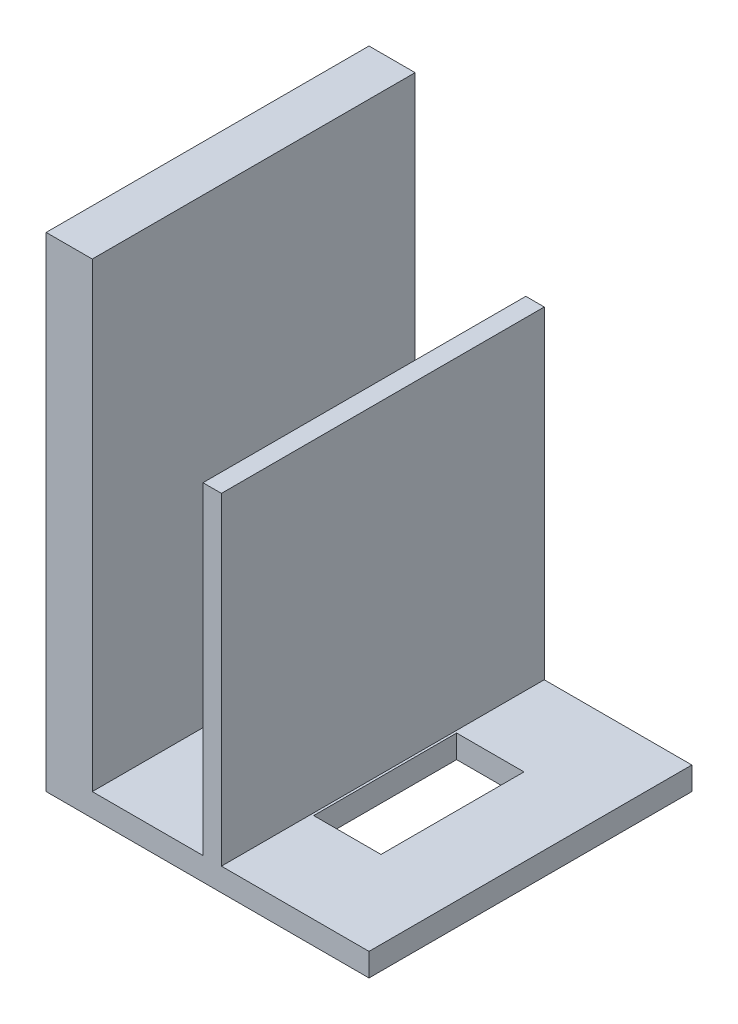
ISO-10303-21;
HEADER;
FILE_DESCRIPTION(('STEP AP214'),'2;1');
FILE_NAME('part.step','',(''),(''),'','','');
FILE_SCHEMA(('AUTOMOTIVE_DESIGN { 1 0 10303 214 1 1 1 1 }'));
ENDSEC;
DATA;
#1=APPLICATION_CONTEXT('core data for automotive mechanical design processes');
#2=APPLICATION_PROTOCOL_DEFINITION('international standard','automotive_design',2000,#1);
#3=PRODUCT_CONTEXT('',#1,'mechanical');
#4=PRODUCT('Part','Part','',(#3));
#5=PRODUCT_RELATED_PRODUCT_CATEGORY('part','',(#4));
#6=PRODUCT_DEFINITION_FORMATION('','',#4);
#7=PRODUCT_DEFINITION_CONTEXT('part definition',#1,'design');
#8=PRODUCT_DEFINITION('design','',#6,#7);
#9=PRODUCT_DEFINITION_SHAPE('','',#8);
#10=(LENGTH_UNIT() NAMED_UNIT(*) SI_UNIT(.MILLI.,.METRE.));
#11=(NAMED_UNIT(*) PLANE_ANGLE_UNIT() SI_UNIT($,.RADIAN.));
#12=(NAMED_UNIT(*) SI_UNIT($,.STERADIAN.) SOLID_ANGLE_UNIT());
#13=UNCERTAINTY_MEASURE_WITH_UNIT(LENGTH_MEASURE(1.E-05),#10,'distance_accuracy_value','');
#14=(GEOMETRIC_REPRESENTATION_CONTEXT(3) GLOBAL_UNCERTAINTY_ASSIGNED_CONTEXT((#13)) GLOBAL_UNIT_ASSIGNED_CONTEXT((#10,
#11,#12)) REPRESENTATION_CONTEXT('',''));
#15=CARTESIAN_POINT('',(0.,0.,0.));
#16=DIRECTION('',(0.,0.,1.));
#17=DIRECTION('',(1.,0.,0.));
#18=AXIS2_PLACEMENT_3D('',#15,#16,#17);
#19=CARTESIAN_POINT('',(0.,2.5,0.));
#20=DIRECTION('',(0.,-1.,0.));
#21=DIRECTION('',(0.,0.,-1.));
#22=AXIS2_PLACEMENT_3D('',#19,#20,#21);
#23=PLANE('',#22);
#24=CARTESIAN_POINT('',(10.75,2.5,-17.5));
#25=DIRECTION('',(0.,1.,0.));
#26=DIRECTION('',(0.,0.,1.));
#27=AXIS2_PLACEMENT_3D('',#24,#25,#26);
#28=CIRCLE('',#27,5.);
#29=CARTESIAN_POINT('',(10.75,2.5,-12.5));
#30=VERTEX_POINT('',#29);
#31=EDGE_CURVE('E257',#30,#30,#28,.T.);
#32=ORIENTED_EDGE('',*,*,#31,.F.);
#33=EDGE_LOOP('',(#32));
#34=FACE_BOUND('',#33,.T.);
#35=DIRECTION('',(0.,0.,1.));
#36=VECTOR('',#35,1.);
#37=CARTESIAN_POINT('',(17.,2.5,0.));
#38=LINE('',#37,#36);
#39=CARTESIAN_POINT('',(17.,2.5,-35.));
#40=VERTEX_POINT('',#39);
#41=CARTESIAN_POINT('',(17.,2.5,0.));
#42=VERTEX_POINT('',#41);
#43=EDGE_CURVE('E215',#40,#42,#38,.T.);
#44=ORIENTED_EDGE('',*,*,#43,.F.);
#45=DIRECTION('',(-1.,0.,0.));
#46=VECTOR('',#45,1.);
#47=CARTESIAN_POINT('',(0.,2.5,-35.));
#48=LINE('',#47,#46);
#49=CARTESIAN_POINT('',(4.99999999999999,2.5,-35.));
#50=VERTEX_POINT('',#49);
#51=EDGE_CURVE('E339',#40,#50,#48,.T.);
#52=ORIENTED_EDGE('',*,*,#51,.T.);
#53=DIRECTION('',(0.,0.,-1.));
#54=VECTOR('',#53,1.);
#55=CARTESIAN_POINT('',(4.99999999999999,2.5,-35.));
#56=LINE('',#55,#54);
#57=CARTESIAN_POINT('',(4.99999999999999,2.5,0.));
#58=VERTEX_POINT('',#57);
#59=EDGE_CURVE('E296',#58,#50,#56,.T.);
#60=ORIENTED_EDGE('',*,*,#59,.F.);
#61=DIRECTION('',(1.,0.,0.));
#62=VECTOR('',#61,1.);
#63=CARTESIAN_POINT('',(0.,2.5,0.));
#64=LINE('',#63,#62);
#65=EDGE_CURVE('E332',#58,#42,#64,.T.);
#66=ORIENTED_EDGE('',*,*,#65,.T.);
#67=EDGE_LOOP('',(#44,#52,#60,#66));
#68=FACE_BOUND('',#67,.T.);
#69=ADVANCED_FACE('F45',(#34,#68),#23,.F.);
#70=DIRECTION('',(-1.,0.,0.));
#71=VECTOR('',#70,1.);
#72=CARTESIAN_POINT('',(26.55,2.5,-25.25));
#73=LINE('',#72,#71);
#74=CARTESIAN_POINT('',(26.55,2.5,-25.25));
#75=VERTEX_POINT('',#74);
#76=CARTESIAN_POINT('',(19.25,2.5,-25.25));
#77=VERTEX_POINT('',#76);
#78=EDGE_CURVE('E206',#75,#77,#73,.T.);
#79=ORIENTED_EDGE('',*,*,#78,.F.);
#80=DIRECTION('',(0.,0.,-1.));
#81=VECTOR('',#80,1.);
#82=CARTESIAN_POINT('',(26.55,2.5,-9.75000000000001));
#83=LINE('',#82,#81);
#84=CARTESIAN_POINT('',(26.55,2.5,-9.75000000000001));
#85=VERTEX_POINT('',#84);
#86=EDGE_CURVE('E62',#85,#75,#83,.T.);
#87=ORIENTED_EDGE('',*,*,#86,.F.);
#88=DIRECTION('',(1.,0.,0.));
#89=VECTOR('',#88,1.);
#90=CARTESIAN_POINT('',(26.55,2.5,-9.75000000000001));
#91=LINE('',#90,#89);
#92=CARTESIAN_POINT('',(19.25,2.5,-9.75000000000001));
#93=VERTEX_POINT('',#92);
#94=EDGE_CURVE('E193',#93,#85,#91,.T.);
#95=ORIENTED_EDGE('',*,*,#94,.F.);
#96=DIRECTION('',(0.,0.,1.));
#97=VECTOR('',#96,1.);
#98=CARTESIAN_POINT('',(19.25,2.5,-9.75000000000001));
#99=LINE('',#98,#97);
#100=EDGE_CURVE('E197',#77,#93,#99,.T.);
#101=ORIENTED_EDGE('',*,*,#100,.F.);
#102=EDGE_LOOP('',(#79,#87,#95,#101));
#103=FACE_BOUND('',#102,.T.);
#104=DIRECTION('',(0.,0.,-1.));
#105=VECTOR('',#104,1.);
#106=CARTESIAN_POINT('',(19.,2.5,0.));
#107=LINE('',#106,#105);
#108=CARTESIAN_POINT('',(19.,2.5,0.));
#109=VERTEX_POINT('',#108);
#110=CARTESIAN_POINT('',(19.,2.5,-35.));
#111=VERTEX_POINT('',#110);
#112=EDGE_CURVE('E226',#109,#111,#107,.T.);
#113=ORIENTED_EDGE('',*,*,#112,.F.);
#114=CARTESIAN_POINT('',(35.,2.5,0.));
#115=VERTEX_POINT('',#114);
#116=EDGE_CURVE('E336',#109,#115,#64,.T.);
#117=ORIENTED_EDGE('',*,*,#116,.T.);
#118=DIRECTION('',(0.,0.,-1.));
#119=VECTOR('',#118,1.);
#120=CARTESIAN_POINT('',(35.,2.5,0.));
#121=LINE('',#120,#119);
#122=CARTESIAN_POINT('',(35.,2.5,-35.));
#123=VERTEX_POINT('',#122);
#124=EDGE_CURVE('E335',#115,#123,#121,.T.);
#125=ORIENTED_EDGE('',*,*,#124,.T.);
#126=EDGE_CURVE('E340',#123,#111,#48,.T.);
#127=ORIENTED_EDGE('',*,*,#126,.T.);
#128=EDGE_LOOP('',(#113,#117,#125,#127));
#129=FACE_BOUND('',#128,.T.);
#130=ADVANCED_FACE('F408',(#103,#129),#23,.F.);
#131=CARTESIAN_POINT('',(0.,2.5,0.));
#132=DIRECTION('',(1.,0.,0.));
#133=DIRECTION('',(0.,0.,-1.));
#134=AXIS2_PLACEMENT_3D('',#131,#132,#133);
#135=PLANE('',#134);
#136=DIRECTION('',(0.,0.,1.));
#137=VECTOR('',#136,1.);
#138=CARTESIAN_POINT('',(0.,12.5,-26.0538512246076));
#139=LINE('',#138,#137);
#140=CARTESIAN_POINT('',(0.,12.5,-26.0538512246076));
#141=VERTEX_POINT('',#140);
#142=CARTESIAN_POINT('',(0.,12.5,-9.05385122460765));
#143=VERTEX_POINT('',#142);
#144=EDGE_CURVE('E282',#141,#143,#139,.T.);
#145=ORIENTED_EDGE('',*,*,#144,.F.);
#146=DIRECTION('',(0.,-1.,0.));
#147=VECTOR('',#146,1.);
#148=CARTESIAN_POINT('',(0.,47.5,-26.0538512246077));
#149=LINE('',#148,#147);
#150=CARTESIAN_POINT('',(0.,47.5,-26.0538512246077));
#151=VERTEX_POINT('',#150);
#152=EDGE_CURVE('E279',#151,#141,#149,.T.);
#153=ORIENTED_EDGE('',*,*,#152,.F.);
#154=DIRECTION('',(0.,0.,-1.));
#155=VECTOR('',#154,1.);
#156=CARTESIAN_POINT('',(0.,47.5,-26.0538512246077));
#157=LINE('',#156,#155);
#158=CARTESIAN_POINT('',(0.,47.5,-9.05385122460765));
#159=VERTEX_POINT('',#158);
#160=EDGE_CURVE('E266',#159,#151,#157,.T.);
#161=ORIENTED_EDGE('',*,*,#160,.F.);
#162=DIRECTION('',(0.,1.,0.));
#163=VECTOR('',#162,1.);
#164=CARTESIAN_POINT('',(0.,47.5,-9.05385122460765));
#165=LINE('',#164,#163);
#166=EDGE_CURVE('E286',#143,#159,#165,.T.);
#167=ORIENTED_EDGE('',*,*,#166,.F.);
#168=EDGE_LOOP('',(#145,#153,#161,#167));
#169=FACE_BOUND('',#168,.T.);
#170=DIRECTION('',(0.,0.,1.));
#171=VECTOR('',#170,1.);
#172=CARTESIAN_POINT('',(0.,0.,0.));
#173=LINE('',#172,#171);
#174=CARTESIAN_POINT('',(0.,0.,-35.));
#175=VERTEX_POINT('',#174);
#176=CARTESIAN_POINT('',(0.,0.,0.));
#177=VERTEX_POINT('',#176);
#178=EDGE_CURVE('E331',#175,#177,#173,.T.);
#179=ORIENTED_EDGE('',*,*,#178,.T.);
#180=DIRECTION('',(0.,-1.,0.));
#181=VECTOR('',#180,1.);
#182=CARTESIAN_POINT('',(0.,2.5,0.));
#183=LINE('',#182,#181);
#184=CARTESIAN_POINT('',(0.,52.5,0.));
#185=VERTEX_POINT('',#184);
#186=EDGE_CURVE('E11',#185,#177,#183,.T.);
#187=ORIENTED_EDGE('',*,*,#186,.F.);
#188=DIRECTION('',(0.,0.,1.));
#189=VECTOR('',#188,1.);
#190=CARTESIAN_POINT('',(0.,52.5,-35.));
#191=LINE('',#190,#189);
#192=CARTESIAN_POINT('',(0.,52.5,-35.));
#193=VERTEX_POINT('',#192);
#194=EDGE_CURVE('E306',#193,#185,#191,.T.);
#195=ORIENTED_EDGE('',*,*,#194,.F.);
#196=DIRECTION('',(0.,-1.,0.));
#197=VECTOR('',#196,1.);
#198=CARTESIAN_POINT('',(0.,2.5,-35.));
#199=LINE('',#198,#197);
#200=EDGE_CURVE('E343',#193,#175,#199,.T.);
#201=ORIENTED_EDGE('',*,*,#200,.T.);
#202=EDGE_LOOP('',(#179,#187,#195,#201));
#203=FACE_BOUND('',#202,.T.);
#204=ADVANCED_FACE('F47',(#169,#203),#135,.F.);
#205=CARTESIAN_POINT('',(0.,2.5,0.));
#206=DIRECTION('',(0.,0.,-1.));
#207=DIRECTION('',(-1.,0.,0.));
#208=AXIS2_PLACEMENT_3D('',#205,#206,#207);
#209=PLANE('',#208);
#210=DIRECTION('',(1.,0.,0.));
#211=VECTOR('',#210,1.);
#212=CARTESIAN_POINT('',(0.,0.,0.));
#213=LINE('',#212,#211);
#214=CARTESIAN_POINT('',(35.,0.,0.));
#215=VERTEX_POINT('',#214);
#216=EDGE_CURVE('E347',#177,#215,#213,.T.);
#217=ORIENTED_EDGE('',*,*,#216,.T.);
#218=DIRECTION('',(0.,-1.,0.));
#219=VECTOR('',#218,1.);
#220=CARTESIAN_POINT('',(35.,2.5,0.));
#221=LINE('',#220,#219);
#222=EDGE_CURVE('E55',#115,#215,#221,.T.);
#223=ORIENTED_EDGE('',*,*,#222,.F.);
#224=ORIENTED_EDGE('',*,*,#116,.F.);
#225=DIRECTION('',(0.,-1.,0.));
#226=VECTOR('',#225,1.);
#227=CARTESIAN_POINT('',(19.,37.5,0.));
#228=LINE('',#227,#226);
#229=CARTESIAN_POINT('',(19.,37.5,0.));
#230=VERTEX_POINT('',#229);
#231=EDGE_CURVE('E249',#230,#109,#228,.T.);
#232=ORIENTED_EDGE('',*,*,#231,.F.);
#233=DIRECTION('',(1.,0.,0.));
#234=VECTOR('',#233,1.);
#235=CARTESIAN_POINT('',(17.,37.5,0.));
#236=LINE('',#235,#234);
#237=CARTESIAN_POINT('',(17.,37.5,0.));
#238=VERTEX_POINT('',#237);
#239=EDGE_CURVE('E225',#238,#230,#236,.T.);
#240=ORIENTED_EDGE('',*,*,#239,.F.);
#241=DIRECTION('',(0.,-1.,0.));
#242=VECTOR('',#241,1.);
#243=CARTESIAN_POINT('',(17.,37.5,0.));
#244=LINE('',#243,#242);
#245=EDGE_CURVE('E253',#238,#42,#244,.T.);
#246=ORIENTED_EDGE('',*,*,#245,.T.);
#247=ORIENTED_EDGE('',*,*,#65,.F.);
#248=DIRECTION('',(0.,-1.,0.));
#249=VECTOR('',#248,1.);
#250=CARTESIAN_POINT('',(4.99999999999999,52.5,0.));
#251=LINE('',#250,#249);
#252=CARTESIAN_POINT('',(4.99999999999999,52.5,0.));
#253=VERTEX_POINT('',#252);
#254=EDGE_CURVE('E327',#253,#58,#251,.T.);
#255=ORIENTED_EDGE('',*,*,#254,.F.);
#256=DIRECTION('',(1.,0.,0.));
#257=VECTOR('',#256,1.);
#258=CARTESIAN_POINT('',(0.,52.5,0.));
#259=LINE('',#258,#257);
#260=EDGE_CURVE('E310',#185,#253,#259,.T.);
#261=ORIENTED_EDGE('',*,*,#260,.F.);
#262=ORIENTED_EDGE('',*,*,#186,.T.);
#263=EDGE_LOOP('',(#217,#223,#224,#232,#240,#246,#247,#255,#261,#262));
#264=FACE_BOUND('',#263,.T.);
#265=ADVANCED_FACE('F394',(#264),#209,.F.);
#266=CARTESIAN_POINT('',(35.,2.5,0.));
#267=DIRECTION('',(-1.,0.,0.));
#268=DIRECTION('',(0.,0.,1.));
#269=AXIS2_PLACEMENT_3D('',#266,#267,#268);
#270=PLANE('',#269);
#271=DIRECTION('',(0.,0.,-1.));
#272=VECTOR('',#271,1.);
#273=CARTESIAN_POINT('',(35.,0.,0.));
#274=LINE('',#273,#272);
#275=CARTESIAN_POINT('',(35.,0.,-35.));
#276=VERTEX_POINT('',#275);
#277=EDGE_CURVE('E350',#215,#276,#274,.T.);
#278=ORIENTED_EDGE('',*,*,#277,.T.);
#279=DIRECTION('',(0.,-1.,0.));
#280=VECTOR('',#279,1.);
#281=CARTESIAN_POINT('',(35.,2.5,-35.));
#282=LINE('',#281,#280);
#283=EDGE_CURVE('E359',#123,#276,#282,.T.);
#284=ORIENTED_EDGE('',*,*,#283,.F.);
#285=ORIENTED_EDGE('',*,*,#124,.F.);
#286=ORIENTED_EDGE('',*,*,#222,.T.);
#287=EDGE_LOOP('',(#278,#284,#285,#286));
#288=FACE_BOUND('',#287,.T.);
#289=ADVANCED_FACE('F369',(#288),#270,.F.);
#290=CARTESIAN_POINT('',(0.,2.5,-35.));
#291=DIRECTION('',(0.,0.,1.));
#292=DIRECTION('',(1.,0.,0.));
#293=AXIS2_PLACEMENT_3D('',#290,#291,#292);
#294=PLANE('',#293);
#295=DIRECTION('',(-1.,0.,0.));
#296=VECTOR('',#295,1.);
#297=CARTESIAN_POINT('',(0.,0.,-35.));
#298=LINE('',#297,#296);
#299=EDGE_CURVE('E353',#276,#175,#298,.T.);
#300=ORIENTED_EDGE('',*,*,#299,.T.);
#301=ORIENTED_EDGE('',*,*,#200,.F.);
#302=DIRECTION('',(-1.,0.,0.));
#303=VECTOR('',#302,1.);
#304=CARTESIAN_POINT('',(0.,52.5,-35.));
#305=LINE('',#304,#303);
#306=CARTESIAN_POINT('',(4.99999999999999,52.5,-35.));
#307=VERTEX_POINT('',#306);
#308=EDGE_CURVE('E316',#307,#193,#305,.T.);
#309=ORIENTED_EDGE('',*,*,#308,.F.);
#310=DIRECTION('',(0.,-1.,0.));
#311=VECTOR('',#310,1.);
#312=CARTESIAN_POINT('',(4.99999999999999,52.5,-35.));
#313=LINE('',#312,#311);
#314=EDGE_CURVE('E320',#307,#50,#313,.T.);
#315=ORIENTED_EDGE('',*,*,#314,.T.);
#316=ORIENTED_EDGE('',*,*,#51,.F.);
#317=DIRECTION('',(0.,-1.,0.));
#318=VECTOR('',#317,1.);
#319=CARTESIAN_POINT('',(17.,37.5,-35.));
#320=LINE('',#319,#318);
#321=CARTESIAN_POINT('',(17.,37.5,-35.));
#322=VERTEX_POINT('',#321);
#323=EDGE_CURVE('E235',#322,#40,#320,.T.);
#324=ORIENTED_EDGE('',*,*,#323,.F.);
#325=DIRECTION('',(-1.,0.,0.));
#326=VECTOR('',#325,1.);
#327=CARTESIAN_POINT('',(17.,37.5,-35.));
#328=LINE('',#327,#326);
#329=CARTESIAN_POINT('',(19.,37.5,-35.));
#330=VERTEX_POINT('',#329);
#331=EDGE_CURVE('E232',#330,#322,#328,.T.);
#332=ORIENTED_EDGE('',*,*,#331,.F.);
#333=DIRECTION('',(0.,-1.,0.));
#334=VECTOR('',#333,1.);
#335=CARTESIAN_POINT('',(19.,37.5,-35.));
#336=LINE('',#335,#334);
#337=EDGE_CURVE('E245',#330,#111,#336,.T.);
#338=ORIENTED_EDGE('',*,*,#337,.T.);
#339=ORIENTED_EDGE('',*,*,#126,.F.);
#340=ORIENTED_EDGE('',*,*,#283,.T.);
#341=EDGE_LOOP('',(#300,#301,#309,#315,#316,#324,#332,#338,#339,#340));
#342=FACE_BOUND('',#341,.T.);
#343=ADVANCED_FACE('F377',(#342),#294,.F.);
#344=CARTESIAN_POINT('',(0.,0.,0.));
#345=DIRECTION('',(0.,-1.,0.));
#346=DIRECTION('',(0.,0.,-1.));
#347=AXIS2_PLACEMENT_3D('',#344,#345,#346);
#348=PLANE('',#347);
#349=DIRECTION('',(0.,0.,-1.));
#350=VECTOR('',#349,1.);
#351=CARTESIAN_POINT('',(26.55,0.,-9.75000000000001));
#352=LINE('',#351,#350);
#353=CARTESIAN_POINT('',(26.55,0.,-9.75000000000001));
#354=VERTEX_POINT('',#353);
#355=CARTESIAN_POINT('',(26.55,0.,-25.25));
#356=VERTEX_POINT('',#355);
#357=EDGE_CURVE('E174',#354,#356,#352,.T.);
#358=ORIENTED_EDGE('',*,*,#357,.T.);
#359=DIRECTION('',(-1.,0.,0.));
#360=VECTOR('',#359,1.);
#361=CARTESIAN_POINT('',(26.55,0.,-25.25));
#362=LINE('',#361,#360);
#363=CARTESIAN_POINT('',(19.25,0.,-25.25));
#364=VERTEX_POINT('',#363);
#365=EDGE_CURVE('E184',#356,#364,#362,.T.);
#366=ORIENTED_EDGE('',*,*,#365,.T.);
#367=DIRECTION('',(0.,0.,1.));
#368=VECTOR('',#367,1.);
#369=CARTESIAN_POINT('',(19.25,0.,-9.75000000000001));
#370=LINE('',#369,#368);
#371=CARTESIAN_POINT('',(19.25,0.,-9.75000000000001));
#372=VERTEX_POINT('',#371);
#373=EDGE_CURVE('E70',#364,#372,#370,.T.);
#374=ORIENTED_EDGE('',*,*,#373,.T.);
#375=DIRECTION('',(1.,0.,0.));
#376=VECTOR('',#375,1.);
#377=CARTESIAN_POINT('',(26.55,0.,-9.75000000000001));
#378=LINE('',#377,#376);
#379=EDGE_CURVE('E181',#372,#354,#378,.T.);
#380=ORIENTED_EDGE('',*,*,#379,.T.);
#381=EDGE_LOOP('',(#358,#366,#374,#380));
#382=FACE_BOUND('',#381,.T.);
#383=CARTESIAN_POINT('',(10.75,0.,-17.5));
#384=DIRECTION('',(0.,-1.,0.));
#385=DIRECTION('',(0.,0.,-1.));
#386=AXIS2_PLACEMENT_3D('',#383,#384,#385);
#387=CIRCLE('',#386,5.);
#388=CARTESIAN_POINT('',(10.75,0.,-22.5));
#389=VERTEX_POINT('',#388);
#390=EDGE_CURVE('E49',#389,#389,#387,.T.);
#391=ORIENTED_EDGE('',*,*,#390,.F.);
#392=EDGE_LOOP('',(#391));
#393=FACE_BOUND('',#392,.T.);
#394=ORIENTED_EDGE('',*,*,#178,.F.);
#395=ORIENTED_EDGE('',*,*,#299,.F.);
#396=ORIENTED_EDGE('',*,*,#277,.F.);
#397=ORIENTED_EDGE('',*,*,#216,.F.);
#398=EDGE_LOOP('',(#394,#395,#396,#397));
#399=FACE_BOUND('',#398,.T.);
#400=ADVANCED_FACE('F189',(#382,#393,#399),#348,.T.);
#401=CARTESIAN_POINT('',(4.99999999999999,52.5,-35.));
#402=DIRECTION('',(-1.,0.,0.));
#403=DIRECTION('',(0.,0.,1.));
#404=AXIS2_PLACEMENT_3D('',#401,#402,#403);
#405=PLANE('',#404);
#406=ORIENTED_EDGE('',*,*,#59,.T.);
#407=ORIENTED_EDGE('',*,*,#314,.F.);
#408=DIRECTION('',(0.,0.,-1.));
#409=VECTOR('',#408,1.);
#410=CARTESIAN_POINT('',(4.99999999999999,52.5,-35.));
#411=LINE('',#410,#409);
#412=EDGE_CURVE('E313',#253,#307,#411,.T.);
#413=ORIENTED_EDGE('',*,*,#412,.F.);
#414=ORIENTED_EDGE('',*,*,#254,.T.);
#415=EDGE_LOOP('',(#406,#407,#413,#414));
#416=FACE_BOUND('',#415,.T.);
#417=ADVANCED_FACE('F391',(#416),#405,.F.);
#418=CARTESIAN_POINT('',(0.,52.5,0.));
#419=DIRECTION('',(0.,1.,0.));
#420=DIRECTION('',(0.,0.,1.));
#421=AXIS2_PLACEMENT_3D('',#418,#419,#420);
#422=PLANE('',#421);
#423=ORIENTED_EDGE('',*,*,#194,.T.);
#424=ORIENTED_EDGE('',*,*,#260,.T.);
#425=ORIENTED_EDGE('',*,*,#412,.T.);
#426=ORIENTED_EDGE('',*,*,#308,.T.);
#427=EDGE_LOOP('',(#423,#424,#425,#426));
#428=FACE_BOUND('',#427,.T.);
#429=ADVANCED_FACE('F384',(#428),#422,.T.);
#430=CARTESIAN_POINT('',(3.99999999999999,47.5,-26.0538512246077));
#431=DIRECTION('',(0.,0.,-1.));
#432=DIRECTION('',(-1.,0.,0.));
#433=AXIS2_PLACEMENT_3D('',#430,#431,#432);
#434=PLANE('',#433);
#435=ORIENTED_EDGE('',*,*,#152,.T.);
#436=DIRECTION('',(-1.,0.,0.));
#437=VECTOR('',#436,1.);
#438=CARTESIAN_POINT('',(3.99999999999999,12.5,-26.0538512246076));
#439=LINE('',#438,#437);
#440=CARTESIAN_POINT('',(3.99999999999999,12.5,-26.0538512246076));
#441=VERTEX_POINT('',#440);
#442=EDGE_CURVE('E278',#441,#141,#439,.T.);
#443=ORIENTED_EDGE('',*,*,#442,.F.);
#444=DIRECTION('',(0.,-1.,0.));
#445=VECTOR('',#444,1.);
#446=CARTESIAN_POINT('',(3.99999999999999,47.5,-26.0538512246077));
#447=LINE('',#446,#445);
#448=CARTESIAN_POINT('',(3.99999999999999,47.5,-26.0538512246077));
#449=VERTEX_POINT('',#448);
#450=EDGE_CURVE('E261',#449,#441,#447,.T.);
#451=ORIENTED_EDGE('',*,*,#450,.F.);
#452=DIRECTION('',(-1.,0.,0.));
#453=VECTOR('',#452,1.);
#454=CARTESIAN_POINT('',(3.99999999999999,47.5,-26.0538512246077));
#455=LINE('',#454,#453);
#456=EDGE_CURVE('E293',#449,#151,#455,.T.);
#457=ORIENTED_EDGE('',*,*,#456,.T.);
#458=EDGE_LOOP('',(#435,#443,#451,#457));
#459=FACE_BOUND('',#458,.T.);
#460=ADVANCED_FACE('F438',(#459),#434,.F.);
#461=CARTESIAN_POINT('',(3.99999999999999,47.5,-26.0538512246077));
#462=DIRECTION('',(0.,1.,0.));
#463=DIRECTION('',(0.,0.,1.));
#464=AXIS2_PLACEMENT_3D('',#461,#462,#463);
#465=PLANE('',#464);
#466=ORIENTED_EDGE('',*,*,#160,.T.);
#467=ORIENTED_EDGE('',*,*,#456,.F.);
#468=DIRECTION('',(0.,0.,-1.));
#469=VECTOR('',#468,1.);
#470=CARTESIAN_POINT('',(3.99999999999999,47.5,-26.0538512246077));
#471=LINE('',#470,#469);
#472=CARTESIAN_POINT('',(4.,47.5,-9.05385122460765));
#473=VERTEX_POINT('',#472);
#474=EDGE_CURVE('E274',#473,#449,#471,.T.);
#475=ORIENTED_EDGE('',*,*,#474,.F.);
#476=DIRECTION('',(-1.,0.,0.));
#477=VECTOR('',#476,1.);
#478=CARTESIAN_POINT('',(4.,47.5,-9.05385122460765));
#479=LINE('',#478,#477);
#480=EDGE_CURVE('E297',#473,#159,#479,.T.);
#481=ORIENTED_EDGE('',*,*,#480,.T.);
#482=EDGE_LOOP('',(#466,#467,#475,#481));
#483=FACE_BOUND('',#482,.T.);
#484=ADVANCED_FACE('F441',(#483),#465,.F.);
#485=CARTESIAN_POINT('',(4.,47.5,-9.05385122460765));
#486=DIRECTION('',(0.,0.,1.));
#487=DIRECTION('',(1.,0.,0.));
#488=AXIS2_PLACEMENT_3D('',#485,#486,#487);
#489=PLANE('',#488);
#490=ORIENTED_EDGE('',*,*,#166,.T.);
#491=ORIENTED_EDGE('',*,*,#480,.F.);
#492=DIRECTION('',(0.,1.,0.));
#493=VECTOR('',#492,1.);
#494=CARTESIAN_POINT('',(4.,47.5,-9.05385122460765));
#495=LINE('',#494,#493);
#496=CARTESIAN_POINT('',(4.,12.5,-9.05385122460765));
#497=VERTEX_POINT('',#496);
#498=EDGE_CURVE('E270',#497,#473,#495,.T.);
#499=ORIENTED_EDGE('',*,*,#498,.F.);
#500=DIRECTION('',(-1.,0.,0.));
#501=VECTOR('',#500,1.);
#502=CARTESIAN_POINT('',(4.,12.5,-9.05385122460765));
#503=LINE('',#502,#501);
#504=EDGE_CURVE('E300',#497,#143,#503,.T.);
#505=ORIENTED_EDGE('',*,*,#504,.T.);
#506=EDGE_LOOP('',(#490,#491,#499,#505));
#507=FACE_BOUND('',#506,.T.);
#508=ADVANCED_FACE('F447',(#507),#489,.F.);
#509=CARTESIAN_POINT('',(3.99999999999999,12.5,-26.0538512246076));
#510=DIRECTION('',(0.,-1.,0.));
#511=DIRECTION('',(0.,0.,-1.));
#512=AXIS2_PLACEMENT_3D('',#509,#510,#511);
#513=PLANE('',#512);
#514=ORIENTED_EDGE('',*,*,#144,.T.);
#515=ORIENTED_EDGE('',*,*,#504,.F.);
#516=DIRECTION('',(0.,0.,1.));
#517=VECTOR('',#516,1.);
#518=CARTESIAN_POINT('',(3.99999999999999,12.5,-26.0538512246076));
#519=LINE('',#518,#517);
#520=EDGE_CURVE('E265',#441,#497,#519,.T.);
#521=ORIENTED_EDGE('',*,*,#520,.F.);
#522=ORIENTED_EDGE('',*,*,#442,.T.);
#523=EDGE_LOOP('',(#514,#515,#521,#522));
#524=FACE_BOUND('',#523,.T.);
#525=ADVANCED_FACE('F443',(#524),#513,.F.);
#526=CARTESIAN_POINT('',(4.,0.,0.));
#527=DIRECTION('',(-1.,0.,0.));
#528=DIRECTION('',(0.,0.,1.));
#529=AXIS2_PLACEMENT_3D('',#526,#527,#528);
#530=PLANE('',#529);
#531=ORIENTED_EDGE('',*,*,#450,.T.);
#532=ORIENTED_EDGE('',*,*,#520,.T.);
#533=ORIENTED_EDGE('',*,*,#498,.T.);
#534=ORIENTED_EDGE('',*,*,#474,.T.);
#535=EDGE_LOOP('',(#531,#532,#533,#534));
#536=FACE_BOUND('',#535,.T.);
#537=ADVANCED_FACE('F446',(#536),#530,.T.);
#538=CARTESIAN_POINT('',(10.75,-7.5,-17.5));
#539=DIRECTION('',(0.,1.,0.));
#540=DIRECTION('',(0.,0.,1.));
#541=AXIS2_PLACEMENT_3D('',#538,#539,#540);
#542=CYLINDRICAL_SURFACE('',#541,5.);
#543=ORIENTED_EDGE('',*,*,#390,.T.);
#544=EDGE_LOOP('',(#543));
#545=FACE_BOUND('',#544,.T.);
#546=ORIENTED_EDGE('',*,*,#31,.T.);
#547=EDGE_LOOP('',(#546));
#548=FACE_BOUND('',#547,.T.);
#549=ADVANCED_FACE('F414',(#545,#548),#542,.F.);
#550=CARTESIAN_POINT('',(17.,37.5,0.));
#551=DIRECTION('',(1.,0.,0.));
#552=DIRECTION('',(0.,0.,-1.));
#553=AXIS2_PLACEMENT_3D('',#550,#551,#552);
#554=PLANE('',#553);
#555=ORIENTED_EDGE('',*,*,#43,.T.);
#556=ORIENTED_EDGE('',*,*,#245,.F.);
#557=DIRECTION('',(0.,0.,1.));
#558=VECTOR('',#557,1.);
#559=CARTESIAN_POINT('',(17.,37.5,0.));
#560=LINE('',#559,#558);
#561=EDGE_CURVE('E221',#322,#238,#560,.T.);
#562=ORIENTED_EDGE('',*,*,#561,.F.);
#563=ORIENTED_EDGE('',*,*,#323,.T.);
#564=EDGE_LOOP('',(#555,#556,#562,#563));
#565=FACE_BOUND('',#564,.T.);
#566=ADVANCED_FACE('F399',(#565),#554,.F.);
#567=CARTESIAN_POINT('',(19.,37.5,0.));
#568=DIRECTION('',(-1.,0.,0.));
#569=DIRECTION('',(0.,0.,1.));
#570=AXIS2_PLACEMENT_3D('',#567,#568,#569);
#571=PLANE('',#570);
#572=ORIENTED_EDGE('',*,*,#112,.T.);
#573=ORIENTED_EDGE('',*,*,#337,.F.);
#574=DIRECTION('',(0.,0.,-1.));
#575=VECTOR('',#574,1.);
#576=CARTESIAN_POINT('',(19.,37.5,0.));
#577=LINE('',#576,#575);
#578=EDGE_CURVE('E229',#230,#330,#577,.T.);
#579=ORIENTED_EDGE('',*,*,#578,.F.);
#580=ORIENTED_EDGE('',*,*,#231,.T.);
#581=EDGE_LOOP('',(#572,#573,#579,#580));
#582=FACE_BOUND('',#581,.T.);
#583=ADVANCED_FACE('F406',(#582),#571,.F.);
#584=CARTESIAN_POINT('',(0.,37.5,0.));
#585=DIRECTION('',(0.,-1.,0.));
#586=DIRECTION('',(0.,0.,-1.));
#587=AXIS2_PLACEMENT_3D('',#584,#585,#586);
#588=PLANE('',#587);
#589=ORIENTED_EDGE('',*,*,#561,.T.);
#590=ORIENTED_EDGE('',*,*,#239,.T.);
#591=ORIENTED_EDGE('',*,*,#578,.T.);
#592=ORIENTED_EDGE('',*,*,#331,.T.);
#593=EDGE_LOOP('',(#589,#590,#591,#592));
#594=FACE_BOUND('',#593,.T.);
#595=ADVANCED_FACE('F403',(#594),#588,.F.);
#596=CARTESIAN_POINT('',(26.55,0.,-9.75000000000001));
#597=DIRECTION('',(1.,0.,0.));
#598=DIRECTION('',(0.,0.,-1.));
#599=AXIS2_PLACEMENT_3D('',#596,#597,#598);
#600=PLANE('',#599);
#601=ORIENTED_EDGE('',*,*,#86,.T.);
#602=DIRECTION('',(0.,1.,0.));
#603=VECTOR('',#602,1.);
#604=CARTESIAN_POINT('',(26.55,0.,-25.25));
#605=LINE('',#604,#603);
#606=EDGE_CURVE('E170',#356,#75,#605,.T.);
#607=ORIENTED_EDGE('',*,*,#606,.F.);
#608=ORIENTED_EDGE('',*,*,#357,.F.);
#609=DIRECTION('',(0.,1.,0.));
#610=VECTOR('',#609,1.);
#611=CARTESIAN_POINT('',(26.55,0.,-9.75000000000001));
#612=LINE('',#611,#610);
#613=EDGE_CURVE('E212',#354,#85,#612,.T.);
#614=ORIENTED_EDGE('',*,*,#613,.T.);
#615=EDGE_LOOP('',(#601,#607,#608,#614));
#616=FACE_BOUND('',#615,.T.);
#617=ADVANCED_FACE('F172',(#616),#600,.F.);
#618=CARTESIAN_POINT('',(26.55,0.,-9.75000000000001));
#619=DIRECTION('',(0.,0.,1.));
#620=DIRECTION('',(1.,0.,0.));
#621=AXIS2_PLACEMENT_3D('',#618,#619,#620);
#622=PLANE('',#621);
#623=ORIENTED_EDGE('',*,*,#94,.T.);
#624=ORIENTED_EDGE('',*,*,#613,.F.);
#625=ORIENTED_EDGE('',*,*,#379,.F.);
#626=DIRECTION('',(0.,1.,0.));
#627=VECTOR('',#626,1.);
#628=CARTESIAN_POINT('',(19.25,0.,-9.75000000000001));
#629=LINE('',#628,#627);
#630=EDGE_CURVE('E216',#372,#93,#629,.T.);
#631=ORIENTED_EDGE('',*,*,#630,.T.);
#632=EDGE_LOOP('',(#623,#624,#625,#631));
#633=FACE_BOUND('',#632,.T.);
#634=ADVANCED_FACE('F466',(#633),#622,.F.);
#635=CARTESIAN_POINT('',(19.25,0.,-9.75000000000001));
#636=DIRECTION('',(-1.,0.,0.));
#637=DIRECTION('',(0.,0.,1.));
#638=AXIS2_PLACEMENT_3D('',#635,#636,#637);
#639=PLANE('',#638);
#640=ORIENTED_EDGE('',*,*,#100,.T.);
#641=ORIENTED_EDGE('',*,*,#630,.F.);
#642=ORIENTED_EDGE('',*,*,#373,.F.);
#643=DIRECTION('',(0.,1.,0.));
#644=VECTOR('',#643,1.);
#645=CARTESIAN_POINT('',(19.25,0.,-25.25));
#646=LINE('',#645,#644);
#647=EDGE_CURVE('E180',#364,#77,#646,.T.);
#648=ORIENTED_EDGE('',*,*,#647,.T.);
#649=EDGE_LOOP('',(#640,#641,#642,#648));
#650=FACE_BOUND('',#649,.T.);
#651=ADVANCED_FACE('F469',(#650),#639,.F.);
#652=CARTESIAN_POINT('',(26.55,0.,-25.25));
#653=DIRECTION('',(0.,0.,-1.));
#654=DIRECTION('',(-1.,0.,0.));
#655=AXIS2_PLACEMENT_3D('',#652,#653,#654);
#656=PLANE('',#655);
#657=ORIENTED_EDGE('',*,*,#78,.T.);
#658=ORIENTED_EDGE('',*,*,#647,.F.);
#659=ORIENTED_EDGE('',*,*,#365,.F.);
#660=ORIENTED_EDGE('',*,*,#606,.T.);
#661=EDGE_LOOP('',(#657,#658,#659,#660));
#662=FACE_BOUND('',#661,.T.);
#663=ADVANCED_FACE('F185',(#662),#656,.F.);
#664=CLOSED_SHELL('',(#69,#130,#204,#265,#289,#343,#400,#417,#429,#460,#484,#508,#525,#537,#549,
#566,#583,#595,#617,#634,#651,#663));
#665=MANIFOLD_SOLID_BREP('B2',#664);
#666=ADVANCED_BREP_SHAPE_REPRESENTATION('',(#18,#665),#14);
#667=SHAPE_DEFINITION_REPRESENTATION(#9,#666);
ENDSEC;
END-ISO-10303-21;
